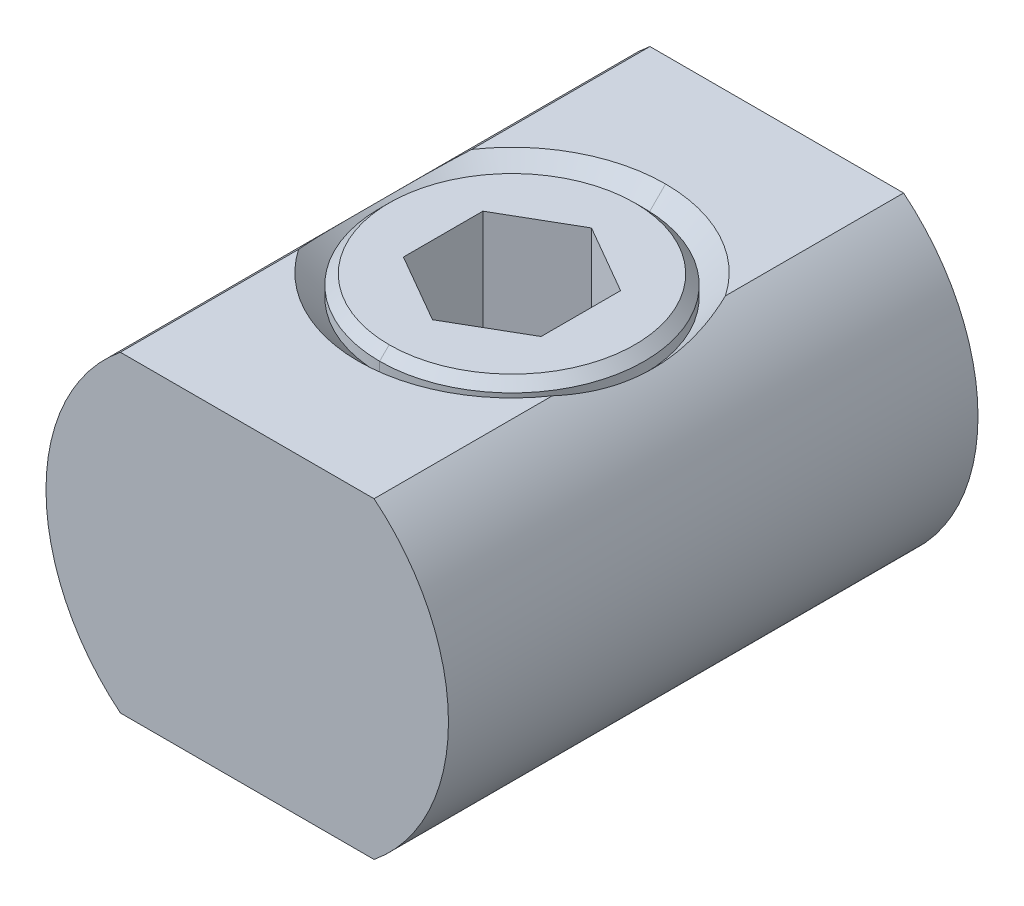
ISO-10303-21;
HEADER;
FILE_DESCRIPTION(('STEP AP214'),'2;1');
FILE_NAME('part.step','',(''),(''),'','','');
FILE_SCHEMA(('AUTOMOTIVE_DESIGN { 1 0 10303 214 1 1 1 1 }'));
ENDSEC;
DATA;
#1=APPLICATION_CONTEXT('core data for automotive mechanical design processes');
#2=APPLICATION_PROTOCOL_DEFINITION('international standard','automotive_design',2000,#1);
#3=PRODUCT_CONTEXT('',#1,'mechanical');
#4=PRODUCT('Part','Part','',(#3));
#5=PRODUCT_RELATED_PRODUCT_CATEGORY('part','',(#4));
#6=PRODUCT_DEFINITION_FORMATION('','',#4);
#7=PRODUCT_DEFINITION_CONTEXT('part definition',#1,'design');
#8=PRODUCT_DEFINITION('design','',#6,#7);
#9=PRODUCT_DEFINITION_SHAPE('','',#8);
#10=(LENGTH_UNIT() NAMED_UNIT(*) SI_UNIT(.MILLI.,.METRE.));
#11=(NAMED_UNIT(*) PLANE_ANGLE_UNIT() SI_UNIT($,.RADIAN.));
#12=(NAMED_UNIT(*) SI_UNIT($,.STERADIAN.) SOLID_ANGLE_UNIT());
#13=UNCERTAINTY_MEASURE_WITH_UNIT(LENGTH_MEASURE(1.E-05),#10,'distance_accuracy_value','');
#14=(GEOMETRIC_REPRESENTATION_CONTEXT(3) GLOBAL_UNCERTAINTY_ASSIGNED_CONTEXT((#13)) GLOBAL_UNIT_ASSIGNED_CONTEXT((#10,
#11,#12)) REPRESENTATION_CONTEXT('',''));
#15=CARTESIAN_POINT('',(0.,0.,0.));
#16=DIRECTION('',(0.,0.,1.));
#17=DIRECTION('',(1.,0.,0.));
#18=AXIS2_PLACEMENT_3D('',#15,#16,#17);
#19=CARTESIAN_POINT('',(0.,2.95,0.));
#20=DIRECTION('',(0.,-1.,0.));
#21=DIRECTION('',(1.,0.,0.));
#22=AXIS2_PLACEMENT_3D('',#19,#20,#21);
#23=CONICAL_SURFACE('',#22,1.15,0.785398163397448);
#24=DIRECTION('',(0.,-0.707106781186548,0.707106781186548));
#25=VECTOR('',#24,1.);
#26=CARTESIAN_POINT('',(0.,2.94,1.16));
#27=LINE('',#26,#25);
#28=CARTESIAN_POINT('',(0.,2.94,1.16));
#29=VERTEX_POINT('',#28);
#30=CARTESIAN_POINT('',(0.,2.85,1.25));
#31=VERTEX_POINT('',#30);
#32=EDGE_CURVE('E11',#29,#31,#27,.T.);
#33=ORIENTED_EDGE('',*,*,#32,.F.);
#34=CARTESIAN_POINT('',(0.,2.94,0.));
#35=DIRECTION('',(0.,1.,0.));
#36=DIRECTION('',(0.,0.,1.));
#37=AXIS2_PLACEMENT_3D('',#34,#35,#36);
#38=CIRCLE('',#37,1.16);
#39=CARTESIAN_POINT('',(0.,2.94,-1.16));
#40=VERTEX_POINT('',#39);
#41=EDGE_CURVE('E24',#40,#29,#38,.T.);
#42=ORIENTED_EDGE('',*,*,#41,.F.);
#43=DIRECTION('',(0.,-0.707106781186548,-0.707106781186548));
#44=VECTOR('',#43,1.);
#45=CARTESIAN_POINT('',(0.,2.94,-1.16));
#46=LINE('',#45,#44);
#47=CARTESIAN_POINT('',(0.,2.85,-1.25));
#48=VERTEX_POINT('',#47);
#49=EDGE_CURVE('E383',#40,#48,#46,.T.);
#50=ORIENTED_EDGE('',*,*,#49,.T.);
#51=CARTESIAN_POINT('',(0.,2.85,0.));
#52=DIRECTION('',(0.,-1.,0.));
#53=DIRECTION('',(0.,0.,-1.));
#54=AXIS2_PLACEMENT_3D('',#51,#52,#53);
#55=CIRCLE('',#54,1.25);
#56=EDGE_CURVE('E378',#31,#48,#55,.T.);
#57=ORIENTED_EDGE('',*,*,#56,.F.);
#58=EDGE_LOOP('',(#33,#42,#50,#57));
#59=FACE_BOUND('',#58,.T.);
#60=ADVANCED_FACE('F16',(#59),#23,.T.);
#61=CARTESIAN_POINT('',(0.,0.,0.));
#62=DIRECTION('',(0.,-1.,0.));
#63=DIRECTION('',(1.,0.,0.));
#64=AXIS2_PLACEMENT_3D('',#61,#62,#63);
#65=CYLINDRICAL_SURFACE('',#64,1.25);
#66=DIRECTION('',(0.,-1.,0.));
#67=VECTOR('',#66,1.);
#68=CARTESIAN_POINT('',(0.,2.85,1.25));
#69=LINE('',#68,#67);
#70=CARTESIAN_POINT('',(0.,2.75,1.25));
#71=VERTEX_POINT('',#70);
#72=EDGE_CURVE('E373',#31,#71,#69,.T.);
#73=ORIENTED_EDGE('',*,*,#72,.F.);
#74=ORIENTED_EDGE('',*,*,#56,.T.);
#75=DIRECTION('',(0.,-1.,0.));
#76=VECTOR('',#75,1.);
#77=CARTESIAN_POINT('',(0.,2.85,-1.25));
#78=LINE('',#77,#76);
#79=CARTESIAN_POINT('',(0.,2.75,-1.25));
#80=VERTEX_POINT('',#79);
#81=EDGE_CURVE('E369',#48,#80,#78,.T.);
#82=ORIENTED_EDGE('',*,*,#81,.T.);
#83=CARTESIAN_POINT('',(0.,2.75,0.));
#84=DIRECTION('',(0.,-1.,0.));
#85=DIRECTION('',(0.,0.,-1.));
#86=AXIS2_PLACEMENT_3D('',#83,#84,#85);
#87=CIRCLE('',#86,1.25);
#88=EDGE_CURVE('E364',#71,#80,#87,.T.);
#89=ORIENTED_EDGE('',*,*,#88,.F.);
#90=EDGE_LOOP('',(#73,#74,#82,#89));
#91=FACE_BOUND('',#90,.T.);
#92=ADVANCED_FACE('F342',(#91),#65,.T.);
#93=CARTESIAN_POINT('',(0.,2.75,0.));
#94=DIRECTION('',(0.,1.,0.));
#95=DIRECTION('',(1.,0.,0.));
#96=AXIS2_PLACEMENT_3D('',#93,#94,#95);
#97=CONICAL_SURFACE('',#96,1.25,0.785398163397447);
#98=DIRECTION('',(0.,0.707106781186549,-0.707106781186546));
#99=VECTOR('',#98,1.);
#100=CARTESIAN_POINT('',(0.,2.75,-1.25));
#101=LINE('',#100,#99);
#102=CARTESIAN_POINT('',(0.,2.95,-1.45));
#103=VERTEX_POINT('',#102);
#104=EDGE_CURVE('E360',#80,#103,#101,.T.);
#105=ORIENTED_EDGE('',*,*,#104,.T.);
#106=CARTESIAN_POINT('',(0.,2.95,0.));
#107=DIRECTION('',(0.,-1.,0.));
#108=DIRECTION('',(0.,0.,-1.));
#109=AXIS2_PLACEMENT_3D('',#106,#107,#108);
#110=CIRCLE('',#109,1.45);
#111=CARTESIAN_POINT('',(-1.1976539567003,2.95,-0.817389136213661));
#112=VERTEX_POINT('',#111);
#113=EDGE_CURVE('E357',#112,#103,#110,.T.);
#114=ORIENTED_EDGE('',*,*,#113,.F.);
#115=CARTESIAN_POINT('',(-1.1976539567003,2.95,0.817389136213661));
#116=CARTESIAN_POINT('',(-1.20499943906959,2.94403534099518,0.796044876758266));
#117=CARTESIAN_POINT('',(-1.21203600378579,2.93823115801739,0.774549421791333));
#118=CARTESIAN_POINT('',(-1.22551400414405,2.9269617962507,0.731225894182507));
#119=CARTESIAN_POINT('',(-1.23195400022894,2.9214974474256,0.709397157807462));
#120=CARTESIAN_POINT('',(-1.24423674402112,2.91094585609487,0.665442832619522));
#121=CARTESIAN_POINT('',(-1.25007853287409,2.90585922249975,0.643316829595896));
#122=CARTESIAN_POINT('',(-1.26116203711495,2.89609989356746,0.598803638407146));
#123=CARTESIAN_POINT('',(-1.2664032399539,2.89142755255154,0.576416244856476));
#124=CARTESIAN_POINT('',(-1.27628251044217,2.88253228688181,0.531416017461366));
#125=CARTESIAN_POINT('',(-1.28092047794947,2.87830943686826,0.508803146855023));
#126=CARTESIAN_POINT('',(-1.28958943539995,2.87034716682095,0.463387730011034));
#127=CARTESIAN_POINT('',(-1.29362070250864,2.86660752614853,0.440585275437996));
#128=CARTESIAN_POINT('',(-1.30107166325794,2.85964381821113,0.394826528792098));
#129=CARTESIAN_POINT('',(-1.30449197468232,2.85641923049012,0.37187041675068));
#130=CARTESIAN_POINT('',(-1.31071440081976,2.85051667981493,0.3258401094905));
#131=CARTESIAN_POINT('',(-1.31351743612449,2.84783790330247,0.302766143352973));
#132=CARTESIAN_POINT('',(-1.31849999043289,2.84305324126789,0.25653637130887));
#133=CARTESIAN_POINT('',(-1.32068068557431,2.84094627547649,0.23338080463088));
#134=CARTESIAN_POINT('',(-1.3244038493367,2.83733666497289,0.186984326875741));
#135=CARTESIAN_POINT('',(-1.32594667924238,2.83583367818258,0.163743471652671));
#136=CARTESIAN_POINT('',(-1.32839172834965,2.83344703885945,0.117138227337522));
#137=CARTESIAN_POINT('',(-1.32929234058334,2.83256493999357,0.0937736747145921));
#138=CARTESIAN_POINT('',(-1.33047031586558,2.8314104857062,0.0469650829009063));
#139=CARTESIAN_POINT('',(-1.33074636824734,2.8311394125539,0.0235209797630228));
#140=CARTESIAN_POINT('',(-1.33068153274638,2.83120303039267,-0.0234013232265701));
#141=CARTESIAN_POINT('',(-1.33033969967211,2.8315386494528,-0.0468795203277396));
#142=CARTESIAN_POINT('',(-1.32904510073533,2.83280703290893,-0.0938242723043985));
#143=CARTESIAN_POINT('',(-1.32809177652428,2.83374034305147,-0.117290796903706));
#144=CARTESIAN_POINT('',(-1.32557720137083,2.8361936553676,-0.164166503616943));
#145=CARTESIAN_POINT('',(-1.3240157942358,2.83771380827718,-0.18757566944181));
#146=CARTESIAN_POINT('',(-1.32028598643623,2.84132779872265,-0.234290904625189));
#147=CARTESIAN_POINT('',(-1.31811784795126,2.84342138845784,-0.257597014107292));
#148=CARTESIAN_POINT('',(-1.31317316192843,2.84816713306461,-0.304060302021385));
#149=CARTESIAN_POINT('',(-1.31039731195929,2.85081864738139,-0.32721762012797));
#150=CARTESIAN_POINT('',(-1.30423441693467,2.85666225415219,-0.373337605739606));
#151=CARTESIAN_POINT('',(-1.30084852168582,2.85985332896384,-0.396300555769178));
#152=CARTESIAN_POINT('',(-1.29345862830044,2.86675798910105,-0.441985444385642));
#153=CARTESIAN_POINT('',(-1.28945625585148,2.87047019794749,-0.464707853555147));
#154=CARTESIAN_POINT('',(-1.28082640492113,2.87839511576093,-0.509903692807996));
#155=CARTESIAN_POINT('',(-1.27620001046081,2.88260695529726,-0.532377483110251));
#156=CARTESIAN_POINT('',(-1.26634472854237,2.89147984407849,-0.577124289452938));
#157=CARTESIAN_POINT('',(-1.26111531377511,2.89614128588512,-0.599397111126049));
#158=CARTESIAN_POINT('',(-1.25005034013955,2.90588379439506,-0.643709278484981));
#159=CARTESIAN_POINT('',(-1.24421453204225,2.91096503345875,-0.665748524036783));
#160=CARTESIAN_POINT('',(-1.23194141152339,2.92150816556906,-0.709561621221625));
#161=CARTESIAN_POINT('',(-1.22550422259579,2.9269699804059,-0.73133552630888));
#162=CARTESIAN_POINT('',(-1.21203023042744,2.93823597986533,-0.774585306120801));
#163=CARTESIAN_POINT('',(-1.20499395747761,2.94403986032944,-0.796061425249165));
#164=CARTESIAN_POINT('',(-1.1976539567003,2.95,-0.81738913621366));
#165=B_SPLINE_CURVE_WITH_KNOTS('',3,(#115,#116,#117,#118,#119,#120,#121,#122,#123,#124,#125,
#126,#127,#128,#129,#130,#131,#132,#133,#134,#135,#136,#137,#138,#139,#140,#141,#142,#143,#144,
#145,#146,#147,#148,#149,#150,#151,#152,#153,#154,#155,#156,#157,#158,#159,#160,#161,#162,#163,
#164),.UNSPECIFIED.,.F.,.F.,(4,2,2,2,2,2,2,2,2,2,2,2,2,2,2,2,2,2,2,2,2,2,2,2,4),(0.,
0.0700397975524778,0.14024442770659,0.210559881720511,0.280934903964581,0.351321594168754,
0.421676030607221,0.491958918559779,0.562136267459855,0.632180098964353,0.702184203349884,
0.772362864319781,0.84268866228395,0.913122130062129,0.983620001903582,1.05413599383523,
1.12462156145893,1.1950266416913,1.26530038555222,1.33539188956132,1.40536316553743,
1.4753960984086,1.54545792968426,1.61550540520953,1.68549150893796),.UNSPECIFIED.);
#166=CARTESIAN_POINT('',(-1.1976539567003,2.95,0.817389136213661));
#167=VERTEX_POINT('',#166);
#168=EDGE_CURVE('E284',#167,#112,#165,.T.);
#169=ORIENTED_EDGE('',*,*,#168,.F.);
#170=CARTESIAN_POINT('',(0.,2.95,0.));
#171=DIRECTION('',(0.,-1.,0.));
#172=DIRECTION('',(0.,0.,-1.));
#173=AXIS2_PLACEMENT_3D('',#170,#171,#172);
#174=CIRCLE('',#173,1.45);
#175=CARTESIAN_POINT('',(0.,2.95,1.45));
#176=VERTEX_POINT('',#175);
#177=EDGE_CURVE('E409',#176,#167,#174,.T.);
#178=ORIENTED_EDGE('',*,*,#177,.F.);
#179=DIRECTION('',(0.,0.707106781186549,0.707106781186546));
#180=VECTOR('',#179,1.);
#181=CARTESIAN_POINT('',(0.,2.75,1.25));
#182=LINE('',#181,#180);
#183=EDGE_CURVE('E407',#71,#176,#182,.T.);
#184=ORIENTED_EDGE('',*,*,#183,.F.);
#185=ORIENTED_EDGE('',*,*,#88,.T.);
#186=EDGE_LOOP('',(#105,#114,#169,#178,#184,#185));
#187=FACE_BOUND('',#186,.T.);
#188=ADVANCED_FACE('F338',(#187),#97,.F.);
#189=CARTESIAN_POINT('',(0.,2.75,0.));
#190=DIRECTION('',(0.,1.,0.));
#191=DIRECTION('',(-1.,0.,0.));
#192=AXIS2_PLACEMENT_3D('',#189,#190,#191);
#193=CONICAL_SURFACE('',#192,1.25,0.785398163397447);
#194=ORIENTED_EDGE('',*,*,#104,.F.);
#195=CARTESIAN_POINT('',(0.,2.75,0.));
#196=DIRECTION('',(0.,-1.,0.));
#197=DIRECTION('',(0.,0.,-1.));
#198=AXIS2_PLACEMENT_3D('',#195,#196,#197);
#199=CIRCLE('',#198,1.25);
#200=EDGE_CURVE('E411',#80,#71,#199,.T.);
#201=ORIENTED_EDGE('',*,*,#200,.T.);
#202=ORIENTED_EDGE('',*,*,#183,.T.);
#203=CARTESIAN_POINT('',(0.,2.95,0.));
#204=DIRECTION('',(0.,-1.,0.));
#205=DIRECTION('',(0.,0.,-1.));
#206=AXIS2_PLACEMENT_3D('',#203,#204,#205);
#207=CIRCLE('',#206,1.45);
#208=CARTESIAN_POINT('',(1.1976539567003,2.95,0.817389136213666));
#209=VERTEX_POINT('',#208);
#210=EDGE_CURVE('E413',#209,#176,#207,.T.);
#211=ORIENTED_EDGE('',*,*,#210,.F.);
#212=CARTESIAN_POINT('',(1.1976539567003,2.95,-0.817389136213663));
#213=CARTESIAN_POINT('',(1.20499943906959,2.94403534099518,-0.796044876758269));
#214=CARTESIAN_POINT('',(1.21203600378579,2.93823115801739,-0.774549421791335));
#215=CARTESIAN_POINT('',(1.22551400414405,2.92696179625069,-0.731225894182509));
#216=CARTESIAN_POINT('',(1.23195400022893,2.9214974474256,-0.709397157807463));
#217=CARTESIAN_POINT('',(1.24423674402112,2.91094585609487,-0.665442832619523));
#218=CARTESIAN_POINT('',(1.25007853287408,2.90585922249974,-0.643316829595897));
#219=CARTESIAN_POINT('',(1.26116203711495,2.89609989356745,-0.598803638407147));
#220=CARTESIAN_POINT('',(1.2664032399539,2.89142755255154,-0.576416244856477));
#221=CARTESIAN_POINT('',(1.27628251044216,2.8825322868818,-0.531416017461367));
#222=CARTESIAN_POINT('',(1.28092047794947,2.87830943686826,-0.508803146855024));
#223=CARTESIAN_POINT('',(1.28958943539994,2.87034716682095,-0.463387730011035));
#224=CARTESIAN_POINT('',(1.29362070250863,2.86660752614853,-0.440585275437997));
#225=CARTESIAN_POINT('',(1.30107166325794,2.85964381821113,-0.394826528792098));
#226=CARTESIAN_POINT('',(1.30449197468232,2.85641923049012,-0.37187041675068));
#227=CARTESIAN_POINT('',(1.31071440081976,2.85051667981492,-0.325840109490501));
#228=CARTESIAN_POINT('',(1.31351743612448,2.84783790330247,-0.302766143352974));
#229=CARTESIAN_POINT('',(1.31849999043289,2.84305324126788,-0.25653637130887));
#230=CARTESIAN_POINT('',(1.3206806855743,2.84094627547649,-0.23338080463088));
#231=CARTESIAN_POINT('',(1.32440384933669,2.83733666497288,-0.186984326875741));
#232=CARTESIAN_POINT('',(1.32594667924237,2.83583367818258,-0.163743471652671));
#233=CARTESIAN_POINT('',(1.32839172834965,2.83344703885945,-0.117138227337522));
#234=CARTESIAN_POINT('',(1.32929234058333,2.83256493999357,-0.0937736747145917));
#235=CARTESIAN_POINT('',(1.33047031586557,2.8314104857062,-0.0469650829009056));
#236=CARTESIAN_POINT('',(1.33074636824733,2.8311394125539,-0.0235209797630217));
#237=CARTESIAN_POINT('',(1.33068153274637,2.83120303039266,0.0234013232265716));
#238=CARTESIAN_POINT('',(1.33033969967211,2.83153864945279,0.0468795203277412));
#239=CARTESIAN_POINT('',(1.32904510073533,2.83280703290893,0.0938242723043996));
#240=CARTESIAN_POINT('',(1.32809177652428,2.83374034305146,0.117290796903706));
#241=CARTESIAN_POINT('',(1.32557720137082,2.8361936553676,0.164166503616944));
#242=CARTESIAN_POINT('',(1.3240157942358,2.83771380827718,0.187575669441811));
#243=CARTESIAN_POINT('',(1.32028598643622,2.84132779872265,0.234290904625191));
#244=CARTESIAN_POINT('',(1.31811784795126,2.84342138845783,0.257597014107294));
#245=CARTESIAN_POINT('',(1.31317316192843,2.84816713306461,0.304060302021387));
#246=CARTESIAN_POINT('',(1.31039731195929,2.85081864738139,0.327217620127971));
#247=CARTESIAN_POINT('',(1.30423441693467,2.85666225415219,0.373337605739608));
#248=CARTESIAN_POINT('',(1.30084852168582,2.85985332896384,0.396300555769181));
#249=CARTESIAN_POINT('',(1.29345862830043,2.86675798910105,0.441985444385646));
#250=CARTESIAN_POINT('',(1.28945625585147,2.87047019794749,0.46470785355515));
#251=CARTESIAN_POINT('',(1.28082640492113,2.87839511576093,0.509903692807999));
#252=CARTESIAN_POINT('',(1.2762000104608,2.88260695529726,0.532377483110255));
#253=CARTESIAN_POINT('',(1.26634472854236,2.89147984407849,0.577124289452941));
#254=CARTESIAN_POINT('',(1.2611153137751,2.89614128588512,0.599397111126053));
#255=CARTESIAN_POINT('',(1.25005034013955,2.90588379439506,0.643709278484985));
#256=CARTESIAN_POINT('',(1.24421453204224,2.91096503345875,0.665748524036787));
#257=CARTESIAN_POINT('',(1.23194141152339,2.92150816556906,0.70956162122163));
#258=CARTESIAN_POINT('',(1.22550422259579,2.9269699804059,0.731335526308885));
#259=CARTESIAN_POINT('',(1.21203023042744,2.93823597986533,0.774585306120806));
#260=CARTESIAN_POINT('',(1.2049939574776,2.94403986032944,0.796061425249171));
#261=CARTESIAN_POINT('',(1.1976539567003,2.95,0.817389136213666));
#262=B_SPLINE_CURVE_WITH_KNOTS('',3,(#212,#213,#214,#215,#216,#217,#218,#219,#220,#221,#222,
#223,#224,#225,#226,#227,#228,#229,#230,#231,#232,#233,#234,#235,#236,#237,#238,#239,#240,#241,
#242,#243,#244,#245,#246,#247,#248,#249,#250,#251,#252,#253,#254,#255,#256,#257,#258,#259,#260,
#261),.UNSPECIFIED.,.F.,.F.,(4,2,2,2,2,2,2,2,2,2,2,2,2,2,2,2,2,2,2,2,2,2,2,2,4),(0.,
0.0700397975524772,0.140244427706591,0.210559881720513,0.280934903964582,0.351321594168755,
0.421676030607222,0.491958918559781,0.562136267459856,0.632180098964355,0.702184203349887,
0.772362864319783,0.842688662283954,0.913122130062133,0.983620001903584,1.05413599383523,
1.12462156145894,1.19502664169131,1.26530038555222,1.33539188956132,1.40536316553744,
1.4753960984086,1.54545792968427,1.61550540520954,1.68549150893797),.UNSPECIFIED.);
#263=CARTESIAN_POINT('',(1.1976539567003,2.95,-0.817389136213663));
#264=VERTEX_POINT('',#263);
#265=EDGE_CURVE('E320',#264,#209,#262,.T.);
#266=ORIENTED_EDGE('',*,*,#265,.F.);
#267=CARTESIAN_POINT('',(0.,2.95,0.));
#268=DIRECTION('',(0.,-1.,0.));
#269=DIRECTION('',(0.,0.,-1.));
#270=AXIS2_PLACEMENT_3D('',#267,#268,#269);
#271=CIRCLE('',#270,1.45);
#272=EDGE_CURVE('E315',#103,#264,#271,.T.);
#273=ORIENTED_EDGE('',*,*,#272,.F.);
#274=EDGE_LOOP('',(#194,#201,#202,#211,#266,#273));
#275=FACE_BOUND('',#274,.T.);
#276=ADVANCED_FACE('F328',(#275),#193,.F.);
#277=CARTESIAN_POINT('',(1.1976539567003,2.95,2.5));
#278=DIRECTION('',(0.,-1.,0.));
#279=DIRECTION('',(0.,0.,-1.));
#280=AXIS2_PLACEMENT_3D('',#277,#278,#279);
#281=PLANE('',#280);
#282=DIRECTION('',(0.,0.,-1.));
#283=VECTOR('',#282,1.);
#284=CARTESIAN_POINT('',(-1.1976539567003,2.95,2.5));
#285=LINE('',#284,#283);
#286=CARTESIAN_POINT('',(-1.1976539567003,2.95,-2.5));
#287=VERTEX_POINT('',#286);
#288=EDGE_CURVE('E311',#112,#287,#285,.T.);
#289=ORIENTED_EDGE('',*,*,#288,.F.);
#290=ORIENTED_EDGE('',*,*,#113,.T.);
#291=ORIENTED_EDGE('',*,*,#272,.T.);
#292=DIRECTION('',(0.,0.,-1.));
#293=VECTOR('',#292,1.);
#294=CARTESIAN_POINT('',(1.1976539567003,2.95,2.5));
#295=LINE('',#294,#293);
#296=CARTESIAN_POINT('',(1.1976539567003,2.95,-2.5));
#297=VERTEX_POINT('',#296);
#298=EDGE_CURVE('E307',#264,#297,#295,.T.);
#299=ORIENTED_EDGE('',*,*,#298,.T.);
#300=DIRECTION('',(-1.,0.,0.));
#301=VECTOR('',#300,1.);
#302=CARTESIAN_POINT('',(1.1976539567003,2.95,-2.5));
#303=LINE('',#302,#301);
#304=EDGE_CURVE('E303',#297,#287,#303,.T.);
#305=ORIENTED_EDGE('',*,*,#304,.T.);
#306=EDGE_LOOP('',(#289,#290,#291,#299,#305));
#307=FACE_BOUND('',#306,.T.);
#308=ADVANCED_FACE('F337',(#307),#281,.F.);
#309=CARTESIAN_POINT('',(0.,1.475,-2.5));
#310=DIRECTION('',(0.,0.,1.));
#311=DIRECTION('',(1.,0.,0.));
#312=AXIS2_PLACEMENT_3D('',#309,#310,#311);
#313=PLANE('',#312);
#314=ORIENTED_EDGE('',*,*,#304,.F.);
#315=CARTESIAN_POINT('',(0.,1.475,-2.5));
#316=DIRECTION('',(0.,0.,1.));
#317=DIRECTION('',(1.,0.,0.));
#318=AXIS2_PLACEMENT_3D('',#315,#316,#317);
#319=CIRCLE('',#318,1.89999999999992);
#320=CARTESIAN_POINT('',(1.1976539567003,0.,-2.5));
#321=VERTEX_POINT('',#320);
#322=EDGE_CURVE('E298',#321,#297,#319,.T.);
#323=ORIENTED_EDGE('',*,*,#322,.F.);
#324=DIRECTION('',(1.,0.,0.));
#325=VECTOR('',#324,1.);
#326=CARTESIAN_POINT('',(-1.1976539567003,0.,-2.5));
#327=LINE('',#326,#325);
#328=CARTESIAN_POINT('',(-1.1976539567003,0.,-2.5));
#329=VERTEX_POINT('',#328);
#330=EDGE_CURVE('E293',#329,#321,#327,.T.);
#331=ORIENTED_EDGE('',*,*,#330,.F.);
#332=CARTESIAN_POINT('',(0.,1.475,-2.5));
#333=DIRECTION('',(0.,0.,1.));
#334=DIRECTION('',(1.,0.,0.));
#335=AXIS2_PLACEMENT_3D('',#332,#333,#334);
#336=CIRCLE('',#335,1.89999999999992);
#337=EDGE_CURVE('E287',#287,#329,#336,.T.);
#338=ORIENTED_EDGE('',*,*,#337,.F.);
#339=EDGE_LOOP('',(#314,#323,#331,#338));
#340=FACE_BOUND('',#339,.T.);
#341=ADVANCED_FACE('F265',(#340),#313,.F.);
#342=CARTESIAN_POINT('',(0.,1.475,2.5));
#343=DIRECTION('',(0.,0.,-1.));
#344=DIRECTION('',(1.,0.,0.));
#345=AXIS2_PLACEMENT_3D('',#342,#343,#344);
#346=CYLINDRICAL_SURFACE('',#345,1.89999999999992);
#347=DIRECTION('',(0.,0.,-1.));
#348=VECTOR('',#347,1.);
#349=CARTESIAN_POINT('',(-1.1976539567003,2.95,2.5));
#350=LINE('',#349,#348);
#351=CARTESIAN_POINT('',(-1.1976539567003,2.95,2.5));
#352=VERTEX_POINT('',#351);
#353=EDGE_CURVE('E285',#352,#167,#350,.T.);
#354=ORIENTED_EDGE('',*,*,#353,.T.);
#355=ORIENTED_EDGE('',*,*,#168,.T.);
#356=ORIENTED_EDGE('',*,*,#288,.T.);
#357=ORIENTED_EDGE('',*,*,#337,.T.);
#358=DIRECTION('',(0.,0.,-1.));
#359=VECTOR('',#358,1.);
#360=CARTESIAN_POINT('',(-1.1976539567003,0.,2.5));
#361=LINE('',#360,#359);
#362=CARTESIAN_POINT('',(-1.1976539567003,0.,2.5));
#363=VERTEX_POINT('',#362);
#364=EDGE_CURVE('E288',#363,#329,#361,.T.);
#365=ORIENTED_EDGE('',*,*,#364,.F.);
#366=CARTESIAN_POINT('',(0.,1.475,2.5));
#367=DIRECTION('',(0.,0.,1.));
#368=DIRECTION('',(1.,0.,0.));
#369=AXIS2_PLACEMENT_3D('',#366,#367,#368);
#370=CIRCLE('',#369,1.89999999999992);
#371=EDGE_CURVE('E432',#352,#363,#370,.T.);
#372=ORIENTED_EDGE('',*,*,#371,.F.);
#373=EDGE_LOOP('',(#354,#355,#356,#357,#365,#372));
#374=FACE_BOUND('',#373,.T.);
#375=ADVANCED_FACE('F260',(#374),#346,.T.);
#376=CARTESIAN_POINT('',(0.,1.475,2.5));
#377=DIRECTION('',(0.,0.,1.));
#378=DIRECTION('',(1.,0.,0.));
#379=AXIS2_PLACEMENT_3D('',#376,#377,#378);
#380=PLANE('',#379);
#381=DIRECTION('',(-1.,0.,0.));
#382=VECTOR('',#381,1.);
#383=CARTESIAN_POINT('',(1.1976539567003,2.95,2.5));
#384=LINE('',#383,#382);
#385=CARTESIAN_POINT('',(1.1976539567003,2.95,2.5));
#386=VERTEX_POINT('',#385);
#387=EDGE_CURVE('E430',#386,#352,#384,.T.);
#388=ORIENTED_EDGE('',*,*,#387,.T.);
#389=ORIENTED_EDGE('',*,*,#371,.T.);
#390=DIRECTION('',(1.,0.,0.));
#391=VECTOR('',#390,1.);
#392=CARTESIAN_POINT('',(-1.1976539567003,0.,2.5));
#393=LINE('',#392,#391);
#394=CARTESIAN_POINT('',(1.1976539567003,0.,2.5));
#395=VERTEX_POINT('',#394);
#396=EDGE_CURVE('E433',#363,#395,#393,.T.);
#397=ORIENTED_EDGE('',*,*,#396,.T.);
#398=CARTESIAN_POINT('',(0.,1.475,2.5));
#399=DIRECTION('',(0.,0.,1.));
#400=DIRECTION('',(1.,0.,0.));
#401=AXIS2_PLACEMENT_3D('',#398,#399,#400);
#402=CIRCLE('',#401,1.89999999999992);
#403=EDGE_CURVE('E235',#395,#386,#402,.T.);
#404=ORIENTED_EDGE('',*,*,#403,.T.);
#405=EDGE_LOOP('',(#388,#389,#397,#404));
#406=FACE_BOUND('',#405,.T.);
#407=ADVANCED_FACE('F255',(#406),#380,.T.);
#408=CARTESIAN_POINT('',(0.,1.475,2.5));
#409=DIRECTION('',(0.,0.,-1.));
#410=DIRECTION('',(-1.,0.,0.));
#411=AXIS2_PLACEMENT_3D('',#408,#409,#410);
#412=CYLINDRICAL_SURFACE('',#411,1.89999999999992);
#413=ORIENTED_EDGE('',*,*,#298,.F.);
#414=ORIENTED_EDGE('',*,*,#265,.T.);
#415=DIRECTION('',(0.,0.,-1.));
#416=VECTOR('',#415,1.);
#417=CARTESIAN_POINT('',(1.1976539567003,2.95,2.5));
#418=LINE('',#417,#416);
#419=EDGE_CURVE('E230',#386,#209,#418,.T.);
#420=ORIENTED_EDGE('',*,*,#419,.F.);
#421=ORIENTED_EDGE('',*,*,#403,.F.);
#422=DIRECTION('',(0.,0.,-1.));
#423=VECTOR('',#422,1.);
#424=CARTESIAN_POINT('',(1.1976539567003,0.,2.5));
#425=LINE('',#424,#423);
#426=EDGE_CURVE('E225',#395,#321,#425,.T.);
#427=ORIENTED_EDGE('',*,*,#426,.T.);
#428=ORIENTED_EDGE('',*,*,#322,.T.);
#429=EDGE_LOOP('',(#413,#414,#420,#421,#427,#428));
#430=FACE_BOUND('',#429,.T.);
#431=ADVANCED_FACE('F244',(#430),#412,.T.);
#432=CARTESIAN_POINT('',(-1.1976539567003,0.,2.5));
#433=DIRECTION('',(0.,1.,0.));
#434=DIRECTION('',(0.,0.,1.));
#435=AXIS2_PLACEMENT_3D('',#432,#433,#434);
#436=PLANE('',#435);
#437=ORIENTED_EDGE('',*,*,#330,.T.);
#438=ORIENTED_EDGE('',*,*,#426,.F.);
#439=ORIENTED_EDGE('',*,*,#396,.F.);
#440=ORIENTED_EDGE('',*,*,#364,.T.);
#441=EDGE_LOOP('',(#437,#438,#439,#440));
#442=FACE_BOUND('',#441,.T.);
#443=ADVANCED_FACE('F254',(#442),#436,.F.);
#444=CARTESIAN_POINT('',(1.1976539567003,2.95,2.5));
#445=DIRECTION('',(0.,-1.,0.));
#446=DIRECTION('',(0.,0.,-1.));
#447=AXIS2_PLACEMENT_3D('',#444,#445,#446);
#448=PLANE('',#447);
#449=ORIENTED_EDGE('',*,*,#419,.T.);
#450=ORIENTED_EDGE('',*,*,#210,.T.);
#451=ORIENTED_EDGE('',*,*,#177,.T.);
#452=ORIENTED_EDGE('',*,*,#353,.F.);
#453=ORIENTED_EDGE('',*,*,#387,.F.);
#454=EDGE_LOOP('',(#449,#450,#451,#452,#453));
#455=FACE_BOUND('',#454,.T.);
#456=ADVANCED_FACE('F427',(#455),#448,.F.);
#457=CARTESIAN_POINT('',(0.,0.,0.));
#458=DIRECTION('',(0.,-1.,0.));
#459=DIRECTION('',(-1.,0.,0.));
#460=AXIS2_PLACEMENT_3D('',#457,#458,#459);
#461=CYLINDRICAL_SURFACE('',#460,1.25);
#462=ORIENTED_EDGE('',*,*,#72,.T.);
#463=ORIENTED_EDGE('',*,*,#200,.F.);
#464=ORIENTED_EDGE('',*,*,#81,.F.);
#465=CARTESIAN_POINT('',(0.,2.85,0.));
#466=DIRECTION('',(0.,-1.,0.));
#467=DIRECTION('',(0.,0.,-1.));
#468=AXIS2_PLACEMENT_3D('',#465,#466,#467);
#469=CIRCLE('',#468,1.25);
#470=EDGE_CURVE('E220',#48,#31,#469,.T.);
#471=ORIENTED_EDGE('',*,*,#470,.T.);
#472=EDGE_LOOP('',(#462,#463,#464,#471));
#473=FACE_BOUND('',#472,.T.);
#474=ADVANCED_FACE('F401',(#473),#461,.T.);
#475=CARTESIAN_POINT('',(0.,2.95,0.));
#476=DIRECTION('',(0.,-1.,0.));
#477=DIRECTION('',(-1.,0.,0.));
#478=AXIS2_PLACEMENT_3D('',#475,#476,#477);
#479=CONICAL_SURFACE('',#478,1.15,0.785398163397448);
#480=ORIENTED_EDGE('',*,*,#32,.T.);
#481=ORIENTED_EDGE('',*,*,#470,.F.);
#482=ORIENTED_EDGE('',*,*,#49,.F.);
#483=CARTESIAN_POINT('',(0.,2.94,0.));
#484=DIRECTION('',(0.,1.,0.));
#485=DIRECTION('',(0.,0.,1.));
#486=AXIS2_PLACEMENT_3D('',#483,#484,#485);
#487=CIRCLE('',#486,1.16);
#488=EDGE_CURVE('E216',#29,#40,#487,.T.);
#489=ORIENTED_EDGE('',*,*,#488,.F.);
#490=EDGE_LOOP('',(#480,#481,#482,#489));
#491=FACE_BOUND('',#490,.T.);
#492=ADVANCED_FACE('F396',(#491),#479,.T.);
#493=CARTESIAN_POINT('',(0.,2.94,0.));
#494=DIRECTION('',(0.,1.,0.));
#495=DIRECTION('',(0.,0.,1.));
#496=AXIS2_PLACEMENT_3D('',#493,#494,#495);
#497=PLANE('',#496);
#498=DIRECTION('',(0.,0.,-1.));
#499=VECTOR('',#498,1.);
#500=CARTESIAN_POINT('',(-0.65,2.94,-0.37527767497326));
#501=LINE('',#500,#499);
#502=CARTESIAN_POINT('',(-0.65,2.94,0.37527767497326));
#503=VERTEX_POINT('',#502);
#504=CARTESIAN_POINT('',(-0.65,2.94,-0.37527767497326));
#505=VERTEX_POINT('',#504);
#506=EDGE_CURVE('E212',#503,#505,#501,.T.);
#507=ORIENTED_EDGE('',*,*,#506,.T.);
#508=DIRECTION('',(0.866025403784443,0.,-0.499999999999993));
#509=VECTOR('',#508,1.);
#510=CARTESIAN_POINT('',(0.,2.94,-0.75055534994651));
#511=LINE('',#510,#509);
#512=CARTESIAN_POINT('',(0.,2.94,-0.75055534994651));
#513=VERTEX_POINT('',#512);
#514=EDGE_CURVE('E208',#505,#513,#511,.T.);
#515=ORIENTED_EDGE('',*,*,#514,.T.);
#516=DIRECTION('',(0.866025403784443,0.,0.499999999999993));
#517=VECTOR('',#516,1.);
#518=CARTESIAN_POINT('',(0.65,2.94,-0.37527767497326));
#519=LINE('',#518,#517);
#520=CARTESIAN_POINT('',(0.65,2.94,-0.37527767497326));
#521=VERTEX_POINT('',#520);
#522=EDGE_CURVE('E204',#513,#521,#519,.T.);
#523=ORIENTED_EDGE('',*,*,#522,.T.);
#524=DIRECTION('',(0.,0.,1.));
#525=VECTOR('',#524,1.);
#526=CARTESIAN_POINT('',(0.65,2.94,0.37527767497326));
#527=LINE('',#526,#525);
#528=CARTESIAN_POINT('',(0.65,2.94,0.37527767497326));
#529=VERTEX_POINT('',#528);
#530=EDGE_CURVE('E200',#521,#529,#527,.T.);
#531=ORIENTED_EDGE('',*,*,#530,.T.);
#532=DIRECTION('',(-0.866025403784443,0.,0.499999999999993));
#533=VECTOR('',#532,1.);
#534=CARTESIAN_POINT('',(0.,2.94,0.75055534994651));
#535=LINE('',#534,#533);
#536=CARTESIAN_POINT('',(0.,2.94,0.75055534994651));
#537=VERTEX_POINT('',#536);
#538=EDGE_CURVE('E148',#529,#537,#535,.T.);
#539=ORIENTED_EDGE('',*,*,#538,.T.);
#540=DIRECTION('',(-0.866025403784443,0.,-0.499999999999993));
#541=VECTOR('',#540,1.);
#542=CARTESIAN_POINT('',(-0.65,2.94,0.37527767497326));
#543=LINE('',#542,#541);
#544=EDGE_CURVE('E193',#537,#503,#543,.T.);
#545=ORIENTED_EDGE('',*,*,#544,.T.);
#546=EDGE_LOOP('',(#507,#515,#523,#531,#539,#545));
#547=FACE_BOUND('',#546,.T.);
#548=ORIENTED_EDGE('',*,*,#488,.T.);
#549=ORIENTED_EDGE('',*,*,#41,.T.);
#550=EDGE_LOOP('',(#548,#549));
#551=FACE_BOUND('',#550,.T.);
#552=ADVANCED_FACE('F392',(#547,#551),#497,.T.);
#553=CARTESIAN_POINT('',(-0.65,1.65,0.37527767497326));
#554=DIRECTION('',(-0.499999999999993,0.,0.866025403784443));
#555=DIRECTION('',(0.866025403784443,0.,0.499999999999993));
#556=AXIS2_PLACEMENT_3D('',#553,#554,#555);
#557=PLANE('',#556);
#558=ORIENTED_EDGE('',*,*,#544,.F.);
#559=DIRECTION('',(0.,1.,0.));
#560=VECTOR('',#559,1.);
#561=CARTESIAN_POINT('',(0.,1.65,0.75055534994651));
#562=LINE('',#561,#560);
#563=CARTESIAN_POINT('',(0.,1.65,0.75055534994651));
#564=VERTEX_POINT('',#563);
#565=EDGE_CURVE('E189',#564,#537,#562,.T.);
#566=ORIENTED_EDGE('',*,*,#565,.F.);
#567=DIRECTION('',(0.866025403784443,0.,0.499999999999993));
#568=VECTOR('',#567,1.);
#569=CARTESIAN_POINT('',(-0.65,1.65,0.37527767497326));
#570=LINE('',#569,#568);
#571=CARTESIAN_POINT('',(-0.65,1.65,0.37527767497326));
#572=VERTEX_POINT('',#571);
#573=EDGE_CURVE('E143',#572,#564,#570,.T.);
#574=ORIENTED_EDGE('',*,*,#573,.F.);
#575=DIRECTION('',(0.,1.,0.));
#576=VECTOR('',#575,1.);
#577=CARTESIAN_POINT('',(-0.65,1.65,0.37527767497326));
#578=LINE('',#577,#576);
#579=EDGE_CURVE('E181',#572,#503,#578,.T.);
#580=ORIENTED_EDGE('',*,*,#579,.T.);
#581=EDGE_LOOP('',(#558,#566,#574,#580));
#582=FACE_BOUND('',#581,.T.);
#583=ADVANCED_FACE('F556',(#582),#557,.F.);
#584=CARTESIAN_POINT('',(-0.65,1.65,-0.37527767497326));
#585=DIRECTION('',(-1.,0.,0.));
#586=DIRECTION('',(0.,0.,1.));
#587=AXIS2_PLACEMENT_3D('',#584,#585,#586);
#588=PLANE('',#587);
#589=ORIENTED_EDGE('',*,*,#506,.F.);
#590=ORIENTED_EDGE('',*,*,#579,.F.);
#591=DIRECTION('',(0.,0.,1.));
#592=VECTOR('',#591,1.);
#593=CARTESIAN_POINT('',(-0.65,1.65,-0.37527767497326));
#594=LINE('',#593,#592);
#595=CARTESIAN_POINT('',(-0.65,1.65,-0.37527767497326));
#596=VERTEX_POINT('',#595);
#597=EDGE_CURVE('E177',#596,#572,#594,.T.);
#598=ORIENTED_EDGE('',*,*,#597,.F.);
#599=DIRECTION('',(0.,1.,0.));
#600=VECTOR('',#599,1.);
#601=CARTESIAN_POINT('',(-0.65,1.65,-0.37527767497326));
#602=LINE('',#601,#600);
#603=EDGE_CURVE('E172',#596,#505,#602,.T.);
#604=ORIENTED_EDGE('',*,*,#603,.T.);
#605=EDGE_LOOP('',(#589,#590,#598,#604));
#606=FACE_BOUND('',#605,.T.);
#607=ADVANCED_FACE('F567',(#606),#588,.F.);
#608=CARTESIAN_POINT('',(0.,1.65,-0.75055534994651));
#609=DIRECTION('',(-0.499999999999993,0.,-0.866025403784443));
#610=DIRECTION('',(-0.866025403784443,0.,0.499999999999993));
#611=AXIS2_PLACEMENT_3D('',#608,#609,#610);
#612=PLANE('',#611);
#613=ORIENTED_EDGE('',*,*,#514,.F.);
#614=ORIENTED_EDGE('',*,*,#603,.F.);
#615=DIRECTION('',(-0.866025403784443,0.,0.499999999999993));
#616=VECTOR('',#615,1.);
#617=CARTESIAN_POINT('',(0.,1.65,-0.75055534994651));
#618=LINE('',#617,#616);
#619=CARTESIAN_POINT('',(0.,1.65,-0.75055534994651));
#620=VERTEX_POINT('',#619);
#621=EDGE_CURVE('E167',#620,#596,#618,.T.);
#622=ORIENTED_EDGE('',*,*,#621,.F.);
#623=DIRECTION('',(0.,1.,0.));
#624=VECTOR('',#623,1.);
#625=CARTESIAN_POINT('',(0.,1.65,-0.75055534994651));
#626=LINE('',#625,#624);
#627=EDGE_CURVE('E162',#620,#513,#626,.T.);
#628=ORIENTED_EDGE('',*,*,#627,.T.);
#629=EDGE_LOOP('',(#613,#614,#622,#628));
#630=FACE_BOUND('',#629,.T.);
#631=ADVANCED_FACE('F578',(#630),#612,.F.);
#632=CARTESIAN_POINT('',(0.65,1.65,-0.37527767497326));
#633=DIRECTION('',(0.499999999999993,0.,-0.866025403784443));
#634=DIRECTION('',(-0.866025403784443,0.,-0.499999999999993));
#635=AXIS2_PLACEMENT_3D('',#632,#633,#634);
#636=PLANE('',#635);
#637=ORIENTED_EDGE('',*,*,#522,.F.);
#638=ORIENTED_EDGE('',*,*,#627,.F.);
#639=DIRECTION('',(-0.866025403784443,0.,-0.499999999999993));
#640=VECTOR('',#639,1.);
#641=CARTESIAN_POINT('',(0.65,1.65,-0.37527767497326));
#642=LINE('',#641,#640);
#643=CARTESIAN_POINT('',(0.65,1.65,-0.37527767497326));
#644=VERTEX_POINT('',#643);
#645=EDGE_CURVE('E158',#644,#620,#642,.T.);
#646=ORIENTED_EDGE('',*,*,#645,.F.);
#647=DIRECTION('',(0.,1.,0.));
#648=VECTOR('',#647,1.);
#649=CARTESIAN_POINT('',(0.65,1.65,-0.37527767497326));
#650=LINE('',#649,#648);
#651=EDGE_CURVE('E134',#644,#521,#650,.T.);
#652=ORIENTED_EDGE('',*,*,#651,.T.);
#653=EDGE_LOOP('',(#637,#638,#646,#652));
#654=FACE_BOUND('',#653,.T.);
#655=ADVANCED_FACE('F589',(#654),#636,.F.);
#656=CARTESIAN_POINT('',(0.65,1.65,0.37527767497326));
#657=DIRECTION('',(1.,0.,0.));
#658=DIRECTION('',(0.,0.,-1.));
#659=AXIS2_PLACEMENT_3D('',#656,#657,#658);
#660=PLANE('',#659);
#661=ORIENTED_EDGE('',*,*,#530,.F.);
#662=ORIENTED_EDGE('',*,*,#651,.F.);
#663=DIRECTION('',(0.,0.,-1.));
#664=VECTOR('',#663,1.);
#665=CARTESIAN_POINT('',(0.65,1.65,0.37527767497326));
#666=LINE('',#665,#664);
#667=CARTESIAN_POINT('',(0.65,1.65,0.37527767497326));
#668=VERTEX_POINT('',#667);
#669=EDGE_CURVE('E126',#668,#644,#666,.T.);
#670=ORIENTED_EDGE('',*,*,#669,.F.);
#671=DIRECTION('',(0.,1.,0.));
#672=VECTOR('',#671,1.);
#673=CARTESIAN_POINT('',(0.65,1.65,0.37527767497326));
#674=LINE('',#673,#672);
#675=EDGE_CURVE('E131',#668,#529,#674,.T.);
#676=ORIENTED_EDGE('',*,*,#675,.T.);
#677=EDGE_LOOP('',(#661,#662,#670,#676));
#678=FACE_BOUND('',#677,.T.);
#679=ADVANCED_FACE('F129',(#678),#660,.F.);
#680=CARTESIAN_POINT('',(0.,1.65,0.75055534994651));
#681=DIRECTION('',(0.499999999999993,0.,0.866025403784443));
#682=DIRECTION('',(0.866025403784443,0.,-0.499999999999993));
#683=AXIS2_PLACEMENT_3D('',#680,#681,#682);
#684=PLANE('',#683);
#685=ORIENTED_EDGE('',*,*,#538,.F.);
#686=ORIENTED_EDGE('',*,*,#675,.F.);
#687=DIRECTION('',(0.866025403784443,0.,-0.499999999999993));
#688=VECTOR('',#687,1.);
#689=CARTESIAN_POINT('',(0.,1.65,0.75055534994651));
#690=LINE('',#689,#688);
#691=EDGE_CURVE('E140',#564,#668,#690,.T.);
#692=ORIENTED_EDGE('',*,*,#691,.F.);
#693=ORIENTED_EDGE('',*,*,#565,.T.);
#694=EDGE_LOOP('',(#685,#686,#692,#693));
#695=FACE_BOUND('',#694,.T.);
#696=ADVANCED_FACE('F147',(#695),#684,.F.);
#697=CARTESIAN_POINT('',(0.,1.65,0.));
#698=DIRECTION('',(0.,1.,0.));
#699=DIRECTION('',(0.,0.,1.));
#700=AXIS2_PLACEMENT_3D('',#697,#698,#699);
#701=PLANE('',#700);
#702=ORIENTED_EDGE('',*,*,#597,.T.);
#703=ORIENTED_EDGE('',*,*,#573,.T.);
#704=ORIENTED_EDGE('',*,*,#691,.T.);
#705=ORIENTED_EDGE('',*,*,#669,.T.);
#706=ORIENTED_EDGE('',*,*,#645,.T.);
#707=ORIENTED_EDGE('',*,*,#621,.T.);
#708=EDGE_LOOP('',(#702,#703,#704,#705,#706,#707));
#709=FACE_BOUND('',#708,.T.);
#710=ADVANCED_FACE('F142',(#709),#701,.T.);
#711=CLOSED_SHELL('',(#60,#92,#188,#276,#308,#341,#375,#407,#431,#443,#456,#474,#492,#552,#583,
#607,#631,#655,#679,#696,#710));
#712=MANIFOLD_SOLID_BREP('B1',#711);
#713=ADVANCED_BREP_SHAPE_REPRESENTATION('',(#18,#712),#14);
#714=SHAPE_DEFINITION_REPRESENTATION(#9,#713);
ENDSEC;
END-ISO-10303-21;
